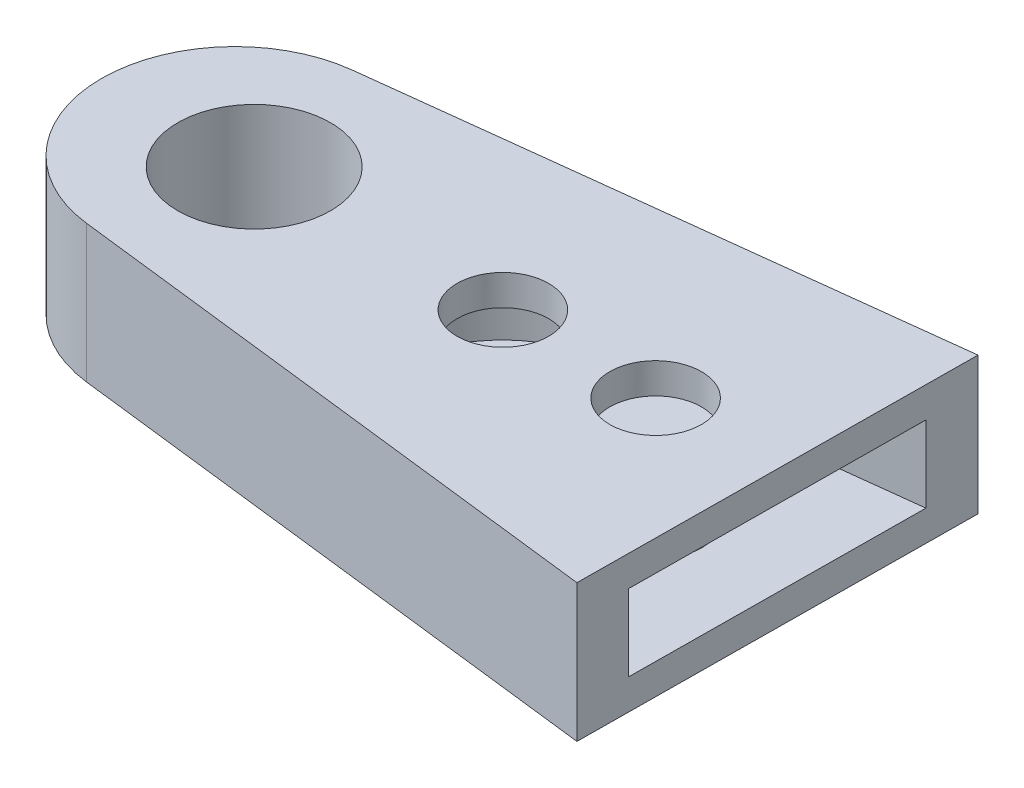
ISO-10303-21;
HEADER;
FILE_DESCRIPTION(('STEP AP214'),'2;1');
FILE_NAME('part.step','',(''),(''),'','','');
FILE_SCHEMA(('AUTOMOTIVE_DESIGN { 1 0 10303 214 1 1 1 1 }'));
ENDSEC;
DATA;
#1=APPLICATION_CONTEXT('core data for automotive mechanical design processes');
#2=APPLICATION_PROTOCOL_DEFINITION('international standard','automotive_design',2000,#1);
#3=PRODUCT_CONTEXT('',#1,'mechanical');
#4=PRODUCT('Part','Part','',(#3));
#5=PRODUCT_RELATED_PRODUCT_CATEGORY('part','',(#4));
#6=PRODUCT_DEFINITION_FORMATION('','',#4);
#7=PRODUCT_DEFINITION_CONTEXT('part definition',#1,'design');
#8=PRODUCT_DEFINITION('design','',#6,#7);
#9=PRODUCT_DEFINITION_SHAPE('','',#8);
#10=(LENGTH_UNIT() NAMED_UNIT(*) SI_UNIT(.MILLI.,.METRE.));
#11=(NAMED_UNIT(*) PLANE_ANGLE_UNIT() SI_UNIT($,.RADIAN.));
#12=(NAMED_UNIT(*) SI_UNIT($,.STERADIAN.) SOLID_ANGLE_UNIT());
#13=UNCERTAINTY_MEASURE_WITH_UNIT(LENGTH_MEASURE(1.E-05),#10,'distance_accuracy_value','');
#14=(GEOMETRIC_REPRESENTATION_CONTEXT(3) GLOBAL_UNCERTAINTY_ASSIGNED_CONTEXT((#13)) GLOBAL_UNIT_ASSIGNED_CONTEXT((#10,
#11,#12)) REPRESENTATION_CONTEXT('',''));
#15=CARTESIAN_POINT('',(0.,0.,0.));
#16=DIRECTION('',(0.,0.,1.));
#17=DIRECTION('',(1.,0.,0.));
#18=AXIS2_PLACEMENT_3D('',#15,#16,#17);
#19=CARTESIAN_POINT('',(71.2290858122236,18.,-26.0240152253046));
#20=DIRECTION('',(-0.999962160434374,0.,-0.0086992930413149));
#21=DIRECTION('',(-0.0086992930413149,0.,0.999962160434374));
#22=AXIS2_PLACEMENT_3D('',#19,#20,#21);
#23=PLANE('',#22);
#24=DIRECTION('',(0.00869929304131513,0.,-0.999962160434374));
#25=VECTOR('',#24,1.);
#26=CARTESIAN_POINT('',(70.8345584692943,14.,19.3259243976569));
#27=LINE('',#26,#25);
#28=CARTESIAN_POINT('',(70.8345584692943,14.,19.3259243976569));
#29=VERTEX_POINT('',#28);
#30=CARTESIAN_POINT('',(71.1702944609414,14.,-19.2660952007919));
#31=VERTEX_POINT('',#30);
#32=EDGE_CURVE('E113',#29,#31,#27,.T.);
#33=ORIENTED_EDGE('',*,*,#32,.T.);
#34=DIRECTION('',(0.,1.,0.));
#35=VECTOR('',#34,1.);
#36=CARTESIAN_POINT('',(71.1702944609414,4.,-19.2660952007919));
#37=LINE('',#36,#35);
#38=CARTESIAN_POINT('',(71.1702944609414,4.,-19.2660952007919));
#39=VERTEX_POINT('',#38);
#40=EDGE_CURVE('E135',#39,#31,#37,.T.);
#41=ORIENTED_EDGE('',*,*,#40,.F.);
#42=DIRECTION('',(0.0086992930413149,0.,-0.999962160434374));
#43=VECTOR('',#42,1.);
#44=CARTESIAN_POINT('',(70.9973133908406,4.,0.617649805933358));
#45=LINE('',#44,#43);
#46=CARTESIAN_POINT('',(70.8345584692943,4.,19.3259243976569));
#47=VERTEX_POINT('',#46);
#48=EDGE_CURVE('E134',#47,#39,#45,.T.);
#49=ORIENTED_EDGE('',*,*,#48,.F.);
#50=DIRECTION('',(0.,1.,0.));
#51=VECTOR('',#50,1.);
#52=CARTESIAN_POINT('',(70.8345584692943,4.,19.3259243976569));
#53=LINE('',#52,#51);
#54=EDGE_CURVE('E127',#47,#29,#53,.T.);
#55=ORIENTED_EDGE('',*,*,#54,.T.);
#56=EDGE_LOOP('',(#33,#41,#49,#55));
#57=FACE_BOUND('',#56,.T.);
#58=DIRECTION('',(0.,-1.,0.));
#59=VECTOR('',#58,1.);
#60=CARTESIAN_POINT('',(71.2290858122236,18.,-26.0240152253046));
#61=LINE('',#60,#59);
#62=CARTESIAN_POINT('',(71.2290858122236,18.,-26.0240152253046));
#63=VERTEX_POINT('',#62);
#64=CARTESIAN_POINT('',(71.2290858122236,0.,-26.0240152253046));
#65=VERTEX_POINT('',#64);
#66=EDGE_CURVE('E160',#63,#65,#61,.T.);
#67=ORIENTED_EDGE('',*,*,#66,.F.);
#68=DIRECTION('',(0.0086992930413149,0.,-0.999962160434374));
#69=VECTOR('',#68,1.);
#70=CARTESIAN_POINT('',(71.2290858122236,18.,-26.0240152253046));
#71=LINE('',#70,#69);
#72=CARTESIAN_POINT('',(70.7762568563824,18.,26.0275502110741));
#73=VERTEX_POINT('',#72);
#74=EDGE_CURVE('E148',#73,#63,#71,.T.);
#75=ORIENTED_EDGE('',*,*,#74,.F.);
#76=DIRECTION('',(0.,-1.,0.));
#77=VECTOR('',#76,1.);
#78=CARTESIAN_POINT('',(70.7762568563824,18.,26.0275502110741));
#79=LINE('',#78,#77);
#80=CARTESIAN_POINT('',(70.7762568563824,0.,26.0275502110741));
#81=VERTEX_POINT('',#80);
#82=EDGE_CURVE('E162',#73,#81,#79,.T.);
#83=ORIENTED_EDGE('',*,*,#82,.T.);
#84=DIRECTION('',(0.0086992930413149,0.,-0.999962160434374));
#85=VECTOR('',#84,1.);
#86=CARTESIAN_POINT('',(71.2290858122236,0.,-26.0240152253046));
#87=LINE('',#86,#85);
#88=EDGE_CURVE('E156',#81,#65,#87,.T.);
#89=ORIENTED_EDGE('',*,*,#88,.T.);
#90=EDGE_LOOP('',(#67,#75,#83,#89));
#91=FACE_BOUND('',#90,.T.);
#92=ADVANCED_FACE('F39',(#57,#91),#23,.F.);
#93=CARTESIAN_POINT('',(0.,18.,0.));
#94=DIRECTION('',(0.,1.,0.));
#95=DIRECTION('',(0.,0.,1.));
#96=AXIS2_PLACEMENT_3D('',#93,#94,#95);
#97=PLANE('',#96);
#98=CARTESIAN_POINT('',(35.001789275487,18.,-0.0534322711610911));
#99=DIRECTION('',(0.,1.,0.));
#100=DIRECTION('',(0.,0.,1.));
#101=AXIS2_PLACEMENT_3D('',#98,#99,#100);
#102=CIRCLE('',#101,6.);
#103=CARTESIAN_POINT('',(35.001789275487,18.,5.94656772883891));
#104=VERTEX_POINT('',#103);
#105=EDGE_CURVE('E171',#104,#104,#102,.T.);
#106=ORIENTED_EDGE('',*,*,#105,.F.);
#107=EDGE_LOOP('',(#106));
#108=FACE_BOUND('',#107,.T.);
#109=CARTESIAN_POINT('',(55.001789275487,18.,-0.0534322711610911));
#110=DIRECTION('',(0.,1.,0.));
#111=DIRECTION('',(0.,0.,1.));
#112=AXIS2_PLACEMENT_3D('',#109,#110,#111);
#113=CIRCLE('',#112,6.);
#114=CARTESIAN_POINT('',(55.001789275487,18.,5.94656772883891));
#115=VERTEX_POINT('',#114);
#116=EDGE_CURVE('E178',#115,#115,#113,.T.);
#117=ORIENTED_EDGE('',*,*,#116,.F.);
#118=EDGE_LOOP('',(#117));
#119=FACE_BOUND('',#118,.T.);
#120=CARTESIAN_POINT('',(2.50000130092295,18.,0.));
#121=DIRECTION('',(0.,1.,0.));
#122=DIRECTION('',(0.,0.,1.));
#123=AXIS2_PLACEMENT_3D('',#120,#121,#122);
#124=CIRCLE('',#123,10.);
#125=CARTESIAN_POINT('',(2.50000130092295,18.,10.));
#126=VERTEX_POINT('',#125);
#127=EDGE_CURVE('E167',#126,#126,#124,.T.);
#128=ORIENTED_EDGE('',*,*,#127,.F.);
#129=EDGE_LOOP('',(#128));
#130=FACE_BOUND('',#129,.T.);
#131=ORIENTED_EDGE('',*,*,#74,.T.);
#132=DIRECTION('',(-0.993113703958447,0.,0.117154474988941));
#133=VECTOR('',#132,1.);
#134=CARTESIAN_POINT('',(-2.05020331230646,18.,-17.3794898192728));
#135=LINE('',#134,#133);
#136=CARTESIAN_POINT('',(-2.05020331230646,18.,-17.3794898192728));
#137=VERTEX_POINT('',#136);
#138=EDGE_CURVE('E64',#63,#137,#135,.T.);
#139=ORIENTED_EDGE('',*,*,#138,.T.);
#140=CARTESIAN_POINT('',(0.,18.,0.));
#141=DIRECTION('',(0.,1.,0.));
#142=DIRECTION('',(0.,0.,1.));
#143=AXIS2_PLACEMENT_3D('',#140,#141,#142);
#144=CIRCLE('',#143,17.5);
#145=CARTESIAN_POINT('',(-2.06360529290366,18.,17.3779035903385));
#146=VERTEX_POINT('',#145);
#147=EDGE_CURVE('E145',#137,#146,#144,.T.);
#148=ORIENTED_EDGE('',*,*,#147,.T.);
#149=DIRECTION('',(0.993023062305057,0.,0.117920302451638));
#150=VECTOR('',#149,1.);
#151=CARTESIAN_POINT('',(-2.06360529290366,18.,17.3779035903385));
#152=LINE('',#151,#150);
#153=EDGE_CURVE('E93',#146,#73,#152,.T.);
#154=ORIENTED_EDGE('',*,*,#153,.T.);
#155=EDGE_LOOP('',(#131,#139,#148,#154));
#156=FACE_BOUND('',#155,.T.);
#157=ADVANCED_FACE('F222',(#108,#119,#130,#156),#97,.T.);
#158=CARTESIAN_POINT('',(0.,18.,0.));
#159=DIRECTION('',(0.,-1.,0.));
#160=DIRECTION('',(0.,0.,-1.));
#161=AXIS2_PLACEMENT_3D('',#158,#159,#160);
#162=CYLINDRICAL_SURFACE('',#161,17.5);
#163=CARTESIAN_POINT('',(0.,0.,0.));
#164=DIRECTION('',(0.,1.,0.));
#165=DIRECTION('',(0.,0.,1.));
#166=AXIS2_PLACEMENT_3D('',#163,#164,#165);
#167=CIRCLE('',#166,17.5);
#168=CARTESIAN_POINT('',(-2.05020331230646,0.,-17.3794898192728));
#169=VERTEX_POINT('',#168);
#170=CARTESIAN_POINT('',(-2.06360529290366,0.,17.3779035903385));
#171=VERTEX_POINT('',#170);
#172=EDGE_CURVE('E137',#169,#171,#167,.T.);
#173=ORIENTED_EDGE('',*,*,#172,.T.);
#174=DIRECTION('',(0.,-1.,0.));
#175=VECTOR('',#174,1.);
#176=CARTESIAN_POINT('',(-2.06360529290366,18.,17.3779035903385));
#177=LINE('',#176,#175);
#178=EDGE_CURVE('E48',#146,#171,#177,.T.);
#179=ORIENTED_EDGE('',*,*,#178,.F.);
#180=ORIENTED_EDGE('',*,*,#147,.F.);
#181=DIRECTION('',(0.,-1.,0.));
#182=VECTOR('',#181,1.);
#183=CARTESIAN_POINT('',(-2.05020331230646,18.,-17.3794898192728));
#184=LINE('',#183,#182);
#185=EDGE_CURVE('E151',#137,#169,#184,.T.);
#186=ORIENTED_EDGE('',*,*,#185,.T.);
#187=EDGE_LOOP('',(#173,#179,#180,#186));
#188=FACE_BOUND('',#187,.T.);
#189=ADVANCED_FACE('F41',(#188),#162,.T.);
#190=CARTESIAN_POINT('',(-2.06360529290366,18.,17.3779035903385));
#191=DIRECTION('',(0.117920302451638,0.,-0.993023062305057));
#192=DIRECTION('',(-0.993023062305058,0.,-0.117920302451638));
#193=AXIS2_PLACEMENT_3D('',#190,#191,#192);
#194=PLANE('',#193);
#195=DIRECTION('',(0.993023062305057,0.,0.117920302451638));
#196=VECTOR('',#195,1.);
#197=CARTESIAN_POINT('',(-2.06360529290366,0.,17.3779035903385));
#198=LINE('',#197,#196);
#199=EDGE_CURVE('E154',#171,#81,#198,.T.);
#200=ORIENTED_EDGE('',*,*,#199,.T.);
#201=ORIENTED_EDGE('',*,*,#82,.F.);
#202=ORIENTED_EDGE('',*,*,#153,.F.);
#203=ORIENTED_EDGE('',*,*,#178,.T.);
#204=EDGE_LOOP('',(#200,#201,#202,#203));
#205=FACE_BOUND('',#204,.T.);
#206=ADVANCED_FACE('F234',(#205),#194,.F.);
#207=CARTESIAN_POINT('',(-2.05020331230646,18.,-17.3794898192728));
#208=DIRECTION('',(0.117154474988941,0.,0.993113703958447));
#209=DIRECTION('',(0.993113703958447,0.,-0.117154474988941));
#210=AXIS2_PLACEMENT_3D('',#207,#208,#209);
#211=PLANE('',#210);
#212=DIRECTION('',(-0.993113703958447,0.,0.117154474988941));
#213=VECTOR('',#212,1.);
#214=CARTESIAN_POINT('',(-2.05020331230646,0.,-17.3794898192728));
#215=LINE('',#214,#213);
#216=EDGE_CURVE('E85',#65,#169,#215,.T.);
#217=ORIENTED_EDGE('',*,*,#216,.T.);
#218=ORIENTED_EDGE('',*,*,#185,.F.);
#219=ORIENTED_EDGE('',*,*,#138,.F.);
#220=ORIENTED_EDGE('',*,*,#66,.T.);
#221=EDGE_LOOP('',(#217,#218,#219,#220));
#222=FACE_BOUND('',#221,.T.);
#223=ADVANCED_FACE('F232',(#222),#211,.F.);
#224=CARTESIAN_POINT('',(0.,0.,0.));
#225=DIRECTION('',(0.,1.,0.));
#226=DIRECTION('',(0.,0.,1.));
#227=AXIS2_PLACEMENT_3D('',#224,#225,#226);
#228=PLANE('',#227);
#229=CARTESIAN_POINT('',(35.001789275487,0.,-0.0534322711610911));
#230=DIRECTION('',(0.,1.,0.));
#231=DIRECTION('',(0.,0.,1.));
#232=AXIS2_PLACEMENT_3D('',#229,#230,#231);
#233=CIRCLE('',#232,6.);
#234=CARTESIAN_POINT('',(35.001789275487,0.,5.94656772883891));
#235=VERTEX_POINT('',#234);
#236=EDGE_CURVE('E190',#235,#235,#233,.T.);
#237=ORIENTED_EDGE('',*,*,#236,.T.);
#238=EDGE_LOOP('',(#237));
#239=FACE_BOUND('',#238,.T.);
#240=CARTESIAN_POINT('',(55.001789275487,0.,-0.0534322711610911));
#241=DIRECTION('',(0.,1.,0.));
#242=DIRECTION('',(0.,0.,1.));
#243=AXIS2_PLACEMENT_3D('',#240,#241,#242);
#244=CIRCLE('',#243,6.);
#245=CARTESIAN_POINT('',(55.001789275487,0.,5.94656772883891));
#246=VERTEX_POINT('',#245);
#247=EDGE_CURVE('E175',#246,#246,#244,.T.);
#248=ORIENTED_EDGE('',*,*,#247,.T.);
#249=EDGE_LOOP('',(#248));
#250=FACE_BOUND('',#249,.T.);
#251=CARTESIAN_POINT('',(2.50000130092295,0.,0.));
#252=DIRECTION('',(0.,1.,0.));
#253=DIRECTION('',(0.,0.,1.));
#254=AXIS2_PLACEMENT_3D('',#251,#252,#253);
#255=CIRCLE('',#254,10.);
#256=CARTESIAN_POINT('',(2.50000130092295,0.,10.));
#257=VERTEX_POINT('',#256);
#258=EDGE_CURVE('E121',#257,#257,#255,.T.);
#259=ORIENTED_EDGE('',*,*,#258,.T.);
#260=EDGE_LOOP('',(#259));
#261=FACE_BOUND('',#260,.T.);
#262=ORIENTED_EDGE('',*,*,#172,.F.);
#263=ORIENTED_EDGE('',*,*,#216,.F.);
#264=ORIENTED_EDGE('',*,*,#88,.F.);
#265=ORIENTED_EDGE('',*,*,#199,.F.);
#266=EDGE_LOOP('',(#262,#263,#264,#265));
#267=FACE_BOUND('',#266,.T.);
#268=ADVANCED_FACE('F239',(#239,#250,#261,#267),#228,.F.);
#269=CARTESIAN_POINT('',(-1.26474168341204,4.,-10.7211636421269));
#270=DIRECTION('',(0.117154474988948,0.,0.993113703958446));
#271=DIRECTION('',(0.993113703958446,0.,-0.117154474988948));
#272=AXIS2_PLACEMENT_3D('',#269,#270,#271);
#273=PLANE('',#272);
#274=DIRECTION('',(0.993113703958446,0.,-0.117154474988948));
#275=VECTOR('',#274,1.);
#276=CARTESIAN_POINT('',(-1.26474168341204,14.,-10.7211636421269));
#277=LINE('',#276,#275);
#278=CARTESIAN_POINT('',(31.5029880771075,14.,-14.5866688318871));
#279=VERTEX_POINT('',#278);
#280=EDGE_CURVE('E116',#279,#31,#277,.T.);
#281=ORIENTED_EDGE('',*,*,#280,.F.);
#282=DIRECTION('',(0.,1.,0.));
#283=VECTOR('',#282,1.);
#284=CARTESIAN_POINT('',(31.5029880771075,4.,-14.5866688318871));
#285=LINE('',#284,#283);
#286=CARTESIAN_POINT('',(31.5029880771075,4.,-14.5866688318871));
#287=VERTEX_POINT('',#286);
#288=EDGE_CURVE('E139',#287,#279,#285,.T.);
#289=ORIENTED_EDGE('',*,*,#288,.F.);
#290=DIRECTION('',(0.993113703958446,0.,-0.117154474988948));
#291=VECTOR('',#290,1.);
#292=CARTESIAN_POINT('',(-1.26474168341204,4.,-10.7211636421269));
#293=LINE('',#292,#291);
#294=EDGE_CURVE('E196',#287,#39,#293,.T.);
#295=ORIENTED_EDGE('',*,*,#294,.T.);
#296=ORIENTED_EDGE('',*,*,#40,.T.);
#297=EDGE_LOOP('',(#281,#289,#295,#296));
#298=FACE_BOUND('',#297,.T.);
#299=ADVANCED_FACE('F207',(#298),#273,.T.);
#300=CARTESIAN_POINT('',(-1.27805043364698,4.,10.762638231198));
#301=DIRECTION('',(-0.117920302451638,0.,0.993023062305058));
#302=DIRECTION('',(0.993023062305058,0.,0.117920302451638));
#303=AXIS2_PLACEMENT_3D('',#300,#301,#302);
#304=PLANE('',#303);
#305=DIRECTION('',(0.,1.,0.));
#306=VECTOR('',#305,1.);
#307=CARTESIAN_POINT('',(32.2251099297947,4.,14.7410985037845));
#308=LINE('',#307,#306);
#309=CARTESIAN_POINT('',(32.2251099297947,4.,14.7410985037845));
#310=VERTEX_POINT('',#309);
#311=CARTESIAN_POINT('',(32.2251099297947,14.,14.7410985037845));
#312=VERTEX_POINT('',#311);
#313=EDGE_CURVE('E129',#310,#312,#308,.T.);
#314=ORIENTED_EDGE('',*,*,#313,.T.);
#315=DIRECTION('',(0.993023062305058,0.,0.117920302451638));
#316=VECTOR('',#315,1.);
#317=CARTESIAN_POINT('',(-1.27805043364698,14.,10.762638231198));
#318=LINE('',#317,#316);
#319=EDGE_CURVE('E56',#312,#29,#318,.T.);
#320=ORIENTED_EDGE('',*,*,#319,.T.);
#321=ORIENTED_EDGE('',*,*,#54,.F.);
#322=DIRECTION('',(0.993023062305058,0.,0.117920302451638));
#323=VECTOR('',#322,1.);
#324=CARTESIAN_POINT('',(-1.27805043364698,4.,10.762638231198));
#325=LINE('',#324,#323);
#326=EDGE_CURVE('E201',#310,#47,#325,.T.);
#327=ORIENTED_EDGE('',*,*,#326,.F.);
#328=EDGE_LOOP('',(#314,#320,#321,#327));
#329=FACE_BOUND('',#328,.T.);
#330=ADVANCED_FACE('F125',(#329),#304,.F.);
#331=CARTESIAN_POINT('',(35.,4.,0.));
#332=DIRECTION('',(0.,1.,0.));
#333=DIRECTION('',(0.,0.,1.));
#334=AXIS2_PLACEMENT_3D('',#331,#332,#333);
#335=CYLINDRICAL_SURFACE('',#334,15.);
#336=ORIENTED_EDGE('',*,*,#288,.T.);
#337=CARTESIAN_POINT('',(35.,14.,0.));
#338=DIRECTION('',(0.,-1.,0.));
#339=DIRECTION('',(0.,0.,-1.));
#340=AXIS2_PLACEMENT_3D('',#337,#338,#339);
#341=CIRCLE('',#340,15.);
#342=EDGE_CURVE('E11',#279,#312,#341,.F.);
#343=ORIENTED_EDGE('',*,*,#342,.T.);
#344=ORIENTED_EDGE('',*,*,#313,.F.);
#345=CARTESIAN_POINT('',(35.,4.,0.));
#346=DIRECTION('',(0.,1.,0.));
#347=DIRECTION('',(0.,0.,1.));
#348=AXIS2_PLACEMENT_3D('',#345,#346,#347);
#349=CIRCLE('',#348,15.);
#350=EDGE_CURVE('E198',#287,#310,#349,.T.);
#351=ORIENTED_EDGE('',*,*,#350,.F.);
#352=EDGE_LOOP('',(#336,#343,#344,#351));
#353=FACE_BOUND('',#352,.T.);
#354=ADVANCED_FACE('F209',(#353),#335,.F.);
#355=CARTESIAN_POINT('',(0.,4.,0.));
#356=DIRECTION('',(0.,1.,0.));
#357=DIRECTION('',(0.,0.,1.));
#358=AXIS2_PLACEMENT_3D('',#355,#356,#357);
#359=PLANE('',#358);
#360=CARTESIAN_POINT('',(35.001789275487,4.,-0.0534322711610911));
#361=DIRECTION('',(0.,1.,0.));
#362=DIRECTION('',(0.,0.,1.));
#363=AXIS2_PLACEMENT_3D('',#360,#361,#362);
#364=CIRCLE('',#363,6.);
#365=CARTESIAN_POINT('',(35.001789275487,4.,5.94656772883891));
#366=VERTEX_POINT('',#365);
#367=EDGE_CURVE('E187',#366,#366,#364,.T.);
#368=ORIENTED_EDGE('',*,*,#367,.F.);
#369=EDGE_LOOP('',(#368));
#370=FACE_BOUND('',#369,.T.);
#371=CARTESIAN_POINT('',(55.001789275487,4.,-0.0534322711610911));
#372=DIRECTION('',(0.,1.,0.));
#373=DIRECTION('',(0.,0.,1.));
#374=AXIS2_PLACEMENT_3D('',#371,#372,#373);
#375=CIRCLE('',#374,6.);
#376=CARTESIAN_POINT('',(55.001789275487,4.,5.94656772883891));
#377=VERTEX_POINT('',#376);
#378=EDGE_CURVE('E170',#377,#377,#375,.T.);
#379=ORIENTED_EDGE('',*,*,#378,.F.);
#380=EDGE_LOOP('',(#379));
#381=FACE_BOUND('',#380,.T.);
#382=ORIENTED_EDGE('',*,*,#294,.F.);
#383=ORIENTED_EDGE('',*,*,#350,.T.);
#384=ORIENTED_EDGE('',*,*,#326,.T.);
#385=ORIENTED_EDGE('',*,*,#48,.T.);
#386=EDGE_LOOP('',(#382,#383,#384,#385));
#387=FACE_BOUND('',#386,.T.);
#388=ADVANCED_FACE('F204',(#370,#381,#387),#359,.T.);
#389=CARTESIAN_POINT('',(19.336507206924,14.,18.8779108060292));
#390=DIRECTION('',(0.,-1.,0.));
#391=DIRECTION('',(0.,0.,-1.));
#392=AXIS2_PLACEMENT_3D('',#389,#390,#391);
#393=PLANE('',#392);
#394=CARTESIAN_POINT('',(35.001789275487,14.,-0.0534322711610911));
#395=DIRECTION('',(0.,-1.,0.));
#396=DIRECTION('',(0.,0.,-1.));
#397=AXIS2_PLACEMENT_3D('',#394,#395,#396);
#398=CIRCLE('',#397,6.);
#399=CARTESIAN_POINT('',(35.001789275487,14.,-6.05343227116109));
#400=VERTEX_POINT('',#399);
#401=EDGE_CURVE('E43',#400,#400,#398,.T.);
#402=ORIENTED_EDGE('',*,*,#401,.F.);
#403=EDGE_LOOP('',(#402));
#404=FACE_BOUND('',#403,.T.);
#405=CARTESIAN_POINT('',(55.001789275487,14.,-0.0534322711610911));
#406=DIRECTION('',(0.,-1.,0.));
#407=DIRECTION('',(0.,0.,-1.));
#408=AXIS2_PLACEMENT_3D('',#405,#406,#407);
#409=CIRCLE('',#408,6.);
#410=CARTESIAN_POINT('',(55.001789275487,14.,-6.05343227116109));
#411=VERTEX_POINT('',#410);
#412=EDGE_CURVE('E168',#411,#411,#409,.T.);
#413=ORIENTED_EDGE('',*,*,#412,.F.);
#414=EDGE_LOOP('',(#413));
#415=FACE_BOUND('',#414,.T.);
#416=ORIENTED_EDGE('',*,*,#342,.F.);
#417=ORIENTED_EDGE('',*,*,#280,.T.);
#418=ORIENTED_EDGE('',*,*,#32,.F.);
#419=ORIENTED_EDGE('',*,*,#319,.F.);
#420=EDGE_LOOP('',(#416,#417,#418,#419));
#421=FACE_BOUND('',#420,.T.);
#422=ADVANCED_FACE('F114',(#404,#415,#421),#393,.T.);
#423=CARTESIAN_POINT('',(2.50000130092295,-182.,0.));
#424=DIRECTION('',(0.,1.,0.));
#425=DIRECTION('',(0.,0.,1.));
#426=AXIS2_PLACEMENT_3D('',#423,#424,#425);
#427=CYLINDRICAL_SURFACE('',#426,10.);
#428=ORIENTED_EDGE('',*,*,#127,.T.);
#429=EDGE_LOOP('',(#428));
#430=FACE_BOUND('',#429,.T.);
#431=ORIENTED_EDGE('',*,*,#258,.F.);
#432=EDGE_LOOP('',(#431));
#433=FACE_BOUND('',#432,.T.);
#434=ADVANCED_FACE('F258',(#430,#433),#427,.F.);
#435=CARTESIAN_POINT('',(55.001789275487,-182.,-0.0534322711610911));
#436=DIRECTION('',(0.,1.,0.));
#437=DIRECTION('',(0.,0.,1.));
#438=AXIS2_PLACEMENT_3D('',#435,#436,#437);
#439=CYLINDRICAL_SURFACE('',#438,6.);
#440=ORIENTED_EDGE('',*,*,#412,.T.);
#441=EDGE_LOOP('',(#440));
#442=FACE_BOUND('',#441,.T.);
#443=ORIENTED_EDGE('',*,*,#116,.T.);
#444=EDGE_LOOP('',(#443));
#445=FACE_BOUND('',#444,.T.);
#446=ADVANCED_FACE('F259',(#442,#445),#439,.F.);
#447=CARTESIAN_POINT('',(35.001789275487,-182.,-0.0534322711610911));
#448=DIRECTION('',(0.,1.,0.));
#449=DIRECTION('',(0.,0.,1.));
#450=AXIS2_PLACEMENT_3D('',#447,#448,#449);
#451=CYLINDRICAL_SURFACE('',#450,6.);
#452=ORIENTED_EDGE('',*,*,#401,.T.);
#453=EDGE_LOOP('',(#452));
#454=FACE_BOUND('',#453,.T.);
#455=ORIENTED_EDGE('',*,*,#105,.T.);
#456=EDGE_LOOP('',(#455));
#457=FACE_BOUND('',#456,.T.);
#458=ADVANCED_FACE('F265',(#454,#457),#451,.F.);
#459=ORIENTED_EDGE('',*,*,#378,.T.);
#460=EDGE_LOOP('',(#459));
#461=FACE_BOUND('',#460,.T.);
#462=ORIENTED_EDGE('',*,*,#247,.F.);
#463=EDGE_LOOP('',(#462));
#464=FACE_BOUND('',#463,.T.);
#465=ADVANCED_FACE('F267',(#461,#464),#439,.F.);
#466=ORIENTED_EDGE('',*,*,#367,.T.);
#467=EDGE_LOOP('',(#466));
#468=FACE_BOUND('',#467,.T.);
#469=ORIENTED_EDGE('',*,*,#236,.F.);
#470=EDGE_LOOP('',(#469));
#471=FACE_BOUND('',#470,.T.);
#472=ADVANCED_FACE('F274',(#468,#471),#451,.F.);
#473=CLOSED_SHELL('',(#92,#157,#189,#206,#223,#268,#299,#330,#354,#388,#422,#434,#446,#458,#465,#472));
#474=MANIFOLD_SOLID_BREP('B2',#473);
#475=ADVANCED_BREP_SHAPE_REPRESENTATION('',(#18,#474),#14);
#476=SHAPE_DEFINITION_REPRESENTATION(#9,#475);
ENDSEC;
END-ISO-10303-21;
